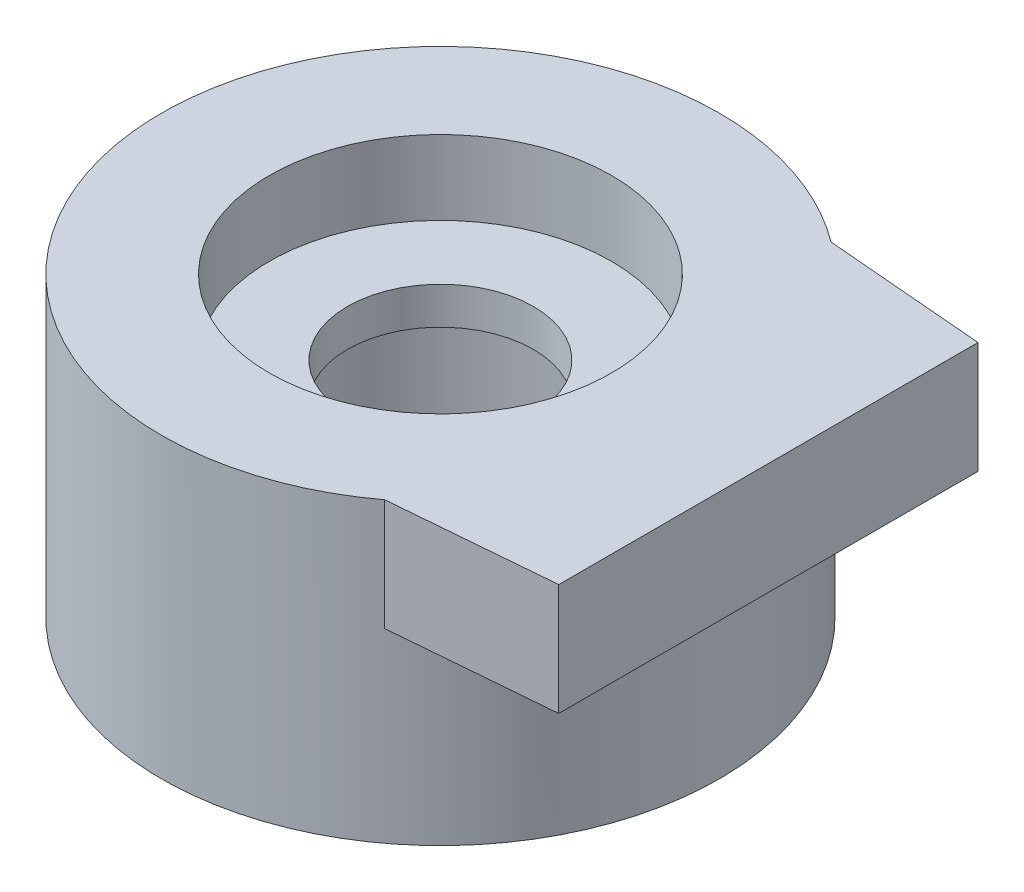
ISO-10303-21;
HEADER;
FILE_DESCRIPTION(('STEP AP214'),'2;1');
FILE_NAME('part.step','',(''),(''),'','','');
FILE_SCHEMA(('AUTOMOTIVE_DESIGN { 1 0 10303 214 1 1 1 1 }'));
ENDSEC;
DATA;
#1=APPLICATION_CONTEXT('core data for automotive mechanical design processes');
#2=APPLICATION_PROTOCOL_DEFINITION('international standard','automotive_design',2000,#1);
#3=PRODUCT_CONTEXT('',#1,'mechanical');
#4=PRODUCT('Part','Part','',(#3));
#5=PRODUCT_RELATED_PRODUCT_CATEGORY('part','',(#4));
#6=PRODUCT_DEFINITION_FORMATION('','',#4);
#7=PRODUCT_DEFINITION_CONTEXT('part definition',#1,'design');
#8=PRODUCT_DEFINITION('design','',#6,#7);
#9=PRODUCT_DEFINITION_SHAPE('','',#8);
#10=(LENGTH_UNIT() NAMED_UNIT(*) SI_UNIT(.MILLI.,.METRE.));
#11=(NAMED_UNIT(*) PLANE_ANGLE_UNIT() SI_UNIT($,.RADIAN.));
#12=(NAMED_UNIT(*) SI_UNIT($,.STERADIAN.) SOLID_ANGLE_UNIT());
#13=UNCERTAINTY_MEASURE_WITH_UNIT(LENGTH_MEASURE(1.E-05),#10,'distance_accuracy_value','');
#14=(GEOMETRIC_REPRESENTATION_CONTEXT(3) GLOBAL_UNCERTAINTY_ASSIGNED_CONTEXT((#13)) GLOBAL_UNIT_ASSIGNED_CONTEXT((#10,
#11,#12)) REPRESENTATION_CONTEXT('',''));
#15=CARTESIAN_POINT('',(0.,0.,0.));
#16=DIRECTION('',(0.,0.,1.));
#17=DIRECTION('',(1.,0.,0.));
#18=AXIS2_PLACEMENT_3D('',#15,#16,#17);
#19=CARTESIAN_POINT('',(0.,-1.5,0.));
#20=DIRECTION('',(0.,1.,0.));
#21=DIRECTION('',(0.,0.,1.));
#22=AXIS2_PLACEMENT_3D('',#19,#20,#21);
#23=CYLINDRICAL_SURFACE('',#22,1.25);
#24=CARTESIAN_POINT('',(0.,3.,0.));
#25=DIRECTION('',(0.,1.,0.));
#26=DIRECTION('',(0.,0.,1.));
#27=AXIS2_PLACEMENT_3D('',#24,#25,#26);
#28=CIRCLE('',#27,1.25);
#29=CARTESIAN_POINT('',(0.,3.,1.25));
#30=VERTEX_POINT('',#29);
#31=EDGE_CURVE('E22',#30,#30,#28,.F.);
#32=ORIENTED_EDGE('',*,*,#31,.F.);
#33=EDGE_LOOP('',(#32));
#34=FACE_BOUND('',#33,.T.);
#35=CARTESIAN_POINT('',(0.,2.5,0.));
#36=DIRECTION('',(0.,1.,0.));
#37=DIRECTION('',(0.,0.,1.));
#38=AXIS2_PLACEMENT_3D('',#35,#36,#37);
#39=CIRCLE('',#38,1.25);
#40=CARTESIAN_POINT('',(0.,2.5,1.25));
#41=VERTEX_POINT('',#40);
#42=EDGE_CURVE('E142',#41,#41,#39,.T.);
#43=ORIENTED_EDGE('',*,*,#42,.F.);
#44=EDGE_LOOP('',(#43));
#45=FACE_BOUND('',#44,.T.);
#46=ADVANCED_FACE('F19',(#34,#45),#23,.F.);
#47=CARTESIAN_POINT('',(0.,3.,0.));
#48=DIRECTION('',(0.,1.,0.));
#49=DIRECTION('',(0.,0.,1.));
#50=AXIS2_PLACEMENT_3D('',#47,#48,#49);
#51=PLANE('',#50);
#52=CARTESIAN_POINT('',(0.,3.,0.));
#53=DIRECTION('',(0.,1.,0.));
#54=DIRECTION('',(0.,0.,1.));
#55=AXIS2_PLACEMENT_3D('',#52,#53,#54);
#56=CIRCLE('',#55,2.3);
#57=CARTESIAN_POINT('',(0.,3.,2.3));
#58=VERTEX_POINT('',#57);
#59=EDGE_CURVE('E88',#58,#58,#56,.T.);
#60=ORIENTED_EDGE('',*,*,#59,.T.);
#61=EDGE_LOOP('',(#60));
#62=FACE_BOUND('',#61,.T.);
#63=ORIENTED_EDGE('',*,*,#31,.T.);
#64=EDGE_LOOP('',(#63));
#65=FACE_BOUND('',#64,.T.);
#66=ADVANCED_FACE('F153',(#62,#65),#51,.T.);
#67=CARTESIAN_POINT('',(0.,2.5,0.));
#68=DIRECTION('',(0.,-1.,0.));
#69=DIRECTION('',(0.,0.,-1.));
#70=AXIS2_PLACEMENT_3D('',#67,#68,#69);
#71=PLANE('',#70);
#72=ORIENTED_EDGE('',*,*,#42,.T.);
#73=EDGE_LOOP('',(#72));
#74=FACE_BOUND('',#73,.T.);
#75=CARTESIAN_POINT('',(0.,2.5,0.));
#76=DIRECTION('',(0.,-1.,0.));
#77=DIRECTION('',(0.,0.,-1.));
#78=AXIS2_PLACEMENT_3D('',#75,#76,#77);
#79=CIRCLE('',#78,2.3);
#80=CARTESIAN_POINT('',(0.,2.5,-2.3));
#81=VERTEX_POINT('',#80);
#82=EDGE_CURVE('E120',#81,#81,#79,.T.);
#83=ORIENTED_EDGE('',*,*,#82,.T.);
#84=EDGE_LOOP('',(#83));
#85=FACE_BOUND('',#84,.T.);
#86=ADVANCED_FACE('F161',(#74,#85),#71,.T.);
#87=CARTESIAN_POINT('',(4.40776789419964,0.,2.81766907451634));
#88=DIRECTION('',(-1.,0.,0.));
#89=DIRECTION('',(0.,0.,1.));
#90=AXIS2_PLACEMENT_3D('',#87,#88,#89);
#91=PLANE('',#90);
#92=DIRECTION('',(0.,1.,0.));
#93=VECTOR('',#92,1.);
#94=CARTESIAN_POINT('',(4.40776789419964,2.5,-2.81766907451634));
#95=LINE('',#94,#93);
#96=CARTESIAN_POINT('',(4.40776789419964,4.,-2.81766907451634));
#97=VERTEX_POINT('',#96);
#98=CARTESIAN_POINT('',(4.40776789419964,2.5,-2.81766907451634));
#99=VERTEX_POINT('',#98);
#100=EDGE_CURVE('E58',#97,#99,#95,.F.);
#101=ORIENTED_EDGE('',*,*,#100,.F.);
#102=DIRECTION('',(0.,0.,1.));
#103=VECTOR('',#102,1.);
#104=CARTESIAN_POINT('',(4.40776789419964,4.,0.));
#105=LINE('',#104,#103);
#106=CARTESIAN_POINT('',(4.40776789419964,4.,2.81766907451634));
#107=VERTEX_POINT('',#106);
#108=EDGE_CURVE('E72',#107,#97,#105,.F.);
#109=ORIENTED_EDGE('',*,*,#108,.F.);
#110=DIRECTION('',(0.,1.,0.));
#111=VECTOR('',#110,1.);
#112=CARTESIAN_POINT('',(4.40776789419964,2.5,2.81766907451634));
#113=LINE('',#112,#111);
#114=CARTESIAN_POINT('',(4.40776789419964,2.5,2.81766907451634));
#115=VERTEX_POINT('',#114);
#116=EDGE_CURVE('E67',#115,#107,#113,.T.);
#117=ORIENTED_EDGE('',*,*,#116,.F.);
#118=DIRECTION('',(0.,0.,-1.));
#119=VECTOR('',#118,1.);
#120=CARTESIAN_POINT('',(4.40776789419964,2.5,0.));
#121=LINE('',#120,#119);
#122=EDGE_CURVE('E70',#99,#115,#121,.F.);
#123=ORIENTED_EDGE('',*,*,#122,.F.);
#124=EDGE_LOOP('',(#101,#109,#117,#123));
#125=FACE_BOUND('',#124,.T.);
#126=ADVANCED_FACE('F68',(#125),#91,.F.);
#127=CARTESIAN_POINT('',(14.1683994375414,2.5,-1.9928977970372));
#128=DIRECTION('',(0.0841997187707069,0.,-0.996448898518601));
#129=DIRECTION('',(-0.996448898518601,0.,-0.0841997187707069));
#130=AXIS2_PLACEMENT_3D('',#127,#128,#129);
#131=PLANE('',#130);
#132=DIRECTION('',(0.,1.,0.));
#133=VECTOR('',#132,1.);
#134=CARTESIAN_POINT('',(2.25,2.5,-3.));
#135=LINE('',#134,#133);
#136=CARTESIAN_POINT('',(2.25,2.5,-3.));
#137=VERTEX_POINT('',#136);
#138=CARTESIAN_POINT('',(2.25,4.,-3.));
#139=VERTEX_POINT('',#138);
#140=EDGE_CURVE('E74',#137,#139,#135,.T.);
#141=ORIENTED_EDGE('',*,*,#140,.T.);
#142=DIRECTION('',(-0.996448898518601,0.,-0.0841997187707062));
#143=VECTOR('',#142,1.);
#144=CARTESIAN_POINT('',(4.40776789419964,4.,-2.81766907451634));
#145=LINE('',#144,#143);
#146=EDGE_CURVE('E119',#97,#139,#145,.T.);
#147=ORIENTED_EDGE('',*,*,#146,.F.);
#148=ORIENTED_EDGE('',*,*,#100,.T.);
#149=DIRECTION('',(0.996448898518601,0.,0.0841997187707062));
#150=VECTOR('',#149,1.);
#151=CARTESIAN_POINT('',(2.25,2.5,-3.));
#152=LINE('',#151,#150);
#153=EDGE_CURVE('E82',#137,#99,#152,.T.);
#154=ORIENTED_EDGE('',*,*,#153,.F.);
#155=EDGE_LOOP('',(#141,#147,#148,#154));
#156=FACE_BOUND('',#155,.T.);
#157=ADVANCED_FACE('F190',(#156),#131,.T.);
#158=CARTESIAN_POINT('',(14.1683994375414,2.5,1.9928977970372));
#159=DIRECTION('',(0.0841997187707063,0.,0.996448898518602));
#160=DIRECTION('',(0.996448898518602,0.,-0.0841997187707063));
#161=AXIS2_PLACEMENT_3D('',#158,#159,#160);
#162=PLANE('',#161);
#163=DIRECTION('',(0.,1.,0.));
#164=VECTOR('',#163,1.);
#165=CARTESIAN_POINT('',(2.25,2.5,3.));
#166=LINE('',#165,#164);
#167=CARTESIAN_POINT('',(2.25,4.,3.));
#168=VERTEX_POINT('',#167);
#169=CARTESIAN_POINT('',(2.25,2.5,3.));
#170=VERTEX_POINT('',#169);
#171=EDGE_CURVE('E38',#168,#170,#166,.F.);
#172=ORIENTED_EDGE('',*,*,#171,.T.);
#173=DIRECTION('',(-0.996448898518602,0.,0.0841997187707063));
#174=VECTOR('',#173,1.);
#175=CARTESIAN_POINT('',(4.40776789419964,2.5,2.81766907451634));
#176=LINE('',#175,#174);
#177=EDGE_CURVE('E76',#115,#170,#176,.T.);
#178=ORIENTED_EDGE('',*,*,#177,.F.);
#179=ORIENTED_EDGE('',*,*,#116,.T.);
#180=DIRECTION('',(0.996448898518602,0.,-0.0841997187707063));
#181=VECTOR('',#180,1.);
#182=CARTESIAN_POINT('',(2.25,4.,3.));
#183=LINE('',#182,#181);
#184=EDGE_CURVE('E136',#168,#107,#183,.T.);
#185=ORIENTED_EDGE('',*,*,#184,.F.);
#186=EDGE_LOOP('',(#172,#178,#179,#185));
#187=FACE_BOUND('',#186,.T.);
#188=ADVANCED_FACE('F77',(#187),#162,.T.);
#189=CARTESIAN_POINT('',(0.,3.,0.));
#190=DIRECTION('',(0.,1.,0.));
#191=DIRECTION('',(0.,0.,1.));
#192=AXIS2_PLACEMENT_3D('',#189,#190,#191);
#193=CYLINDRICAL_SURFACE('',#192,2.3);
#194=CARTESIAN_POINT('',(0.,4.,0.));
#195=DIRECTION('',(0.,1.,0.));
#196=DIRECTION('',(0.,0.,1.));
#197=AXIS2_PLACEMENT_3D('',#194,#195,#196);
#198=CIRCLE('',#197,2.3);
#199=CARTESIAN_POINT('',(0.,4.,2.3));
#200=VERTEX_POINT('',#199);
#201=EDGE_CURVE('E132',#200,#200,#198,.F.);
#202=ORIENTED_EDGE('',*,*,#201,.F.);
#203=EDGE_LOOP('',(#202));
#204=FACE_BOUND('',#203,.T.);
#205=ORIENTED_EDGE('',*,*,#59,.F.);
#206=EDGE_LOOP('',(#205));
#207=FACE_BOUND('',#206,.T.);
#208=ADVANCED_FACE('F184',(#204,#207),#193,.F.);
#209=CARTESIAN_POINT('',(0.,2.5,0.));
#210=DIRECTION('',(0.,-1.,0.));
#211=DIRECTION('',(0.,0.,-1.));
#212=AXIS2_PLACEMENT_3D('',#209,#210,#211);
#213=PLANE('',#212);
#214=CARTESIAN_POINT('',(0.,2.5,0.));
#215=DIRECTION('',(0.,-1.,0.));
#216=DIRECTION('',(0.,0.,-1.));
#217=AXIS2_PLACEMENT_3D('',#214,#215,#216);
#218=CIRCLE('',#217,3.75);
#219=EDGE_CURVE('E128',#137,#170,#218,.T.);
#220=ORIENTED_EDGE('',*,*,#219,.F.);
#221=ORIENTED_EDGE('',*,*,#153,.T.);
#222=ORIENTED_EDGE('',*,*,#122,.T.);
#223=ORIENTED_EDGE('',*,*,#177,.T.);
#224=EDGE_LOOP('',(#220,#221,#222,#223));
#225=FACE_BOUND('',#224,.T.);
#226=ADVANCED_FACE('F85',(#225),#213,.T.);
#227=CARTESIAN_POINT('',(0.,2.5,0.));
#228=DIRECTION('',(0.,-1.,0.));
#229=DIRECTION('',(0.,0.,-1.));
#230=AXIS2_PLACEMENT_3D('',#227,#228,#229);
#231=CYLINDRICAL_SURFACE('',#230,2.3);
#232=ORIENTED_EDGE('',*,*,#82,.F.);
#233=EDGE_LOOP('',(#232));
#234=FACE_BOUND('',#233,.T.);
#235=CARTESIAN_POINT('',(0.,0.,0.));
#236=DIRECTION('',(0.,-1.,0.));
#237=DIRECTION('',(0.,0.,-1.));
#238=AXIS2_PLACEMENT_3D('',#235,#236,#237);
#239=CIRCLE('',#238,2.3);
#240=CARTESIAN_POINT('',(0.,0.,-2.3));
#241=VERTEX_POINT('',#240);
#242=EDGE_CURVE('E102',#241,#241,#239,.T.);
#243=ORIENTED_EDGE('',*,*,#242,.T.);
#244=EDGE_LOOP('',(#243));
#245=FACE_BOUND('',#244,.T.);
#246=ADVANCED_FACE('F177',(#234,#245),#231,.F.);
#247=CARTESIAN_POINT('',(0.,4.,0.));
#248=DIRECTION('',(0.,1.,0.));
#249=DIRECTION('',(0.,0.,1.));
#250=AXIS2_PLACEMENT_3D('',#247,#248,#249);
#251=PLANE('',#250);
#252=ORIENTED_EDGE('',*,*,#201,.T.);
#253=EDGE_LOOP('',(#252));
#254=FACE_BOUND('',#253,.T.);
#255=CARTESIAN_POINT('',(0.,4.,0.));
#256=DIRECTION('',(0.,-1.,0.));
#257=DIRECTION('',(0.,0.,-1.));
#258=AXIS2_PLACEMENT_3D('',#255,#256,#257);
#259=CIRCLE('',#258,3.75);
#260=EDGE_CURVE('E29',#168,#139,#259,.T.);
#261=ORIENTED_EDGE('',*,*,#260,.F.);
#262=ORIENTED_EDGE('',*,*,#184,.T.);
#263=ORIENTED_EDGE('',*,*,#108,.T.);
#264=ORIENTED_EDGE('',*,*,#146,.T.);
#265=EDGE_LOOP('',(#261,#262,#263,#264));
#266=FACE_BOUND('',#265,.T.);
#267=ADVANCED_FACE('F170',(#254,#266),#251,.T.);
#268=CARTESIAN_POINT('',(0.,0.,0.));
#269=DIRECTION('',(0.,1.,0.));
#270=DIRECTION('',(0.,0.,1.));
#271=AXIS2_PLACEMENT_3D('',#268,#269,#270);
#272=PLANE('',#271);
#273=CARTESIAN_POINT('',(0.,0.,0.));
#274=DIRECTION('',(0.,-1.,0.));
#275=DIRECTION('',(0.,0.,-1.));
#276=AXIS2_PLACEMENT_3D('',#273,#274,#275);
#277=CIRCLE('',#276,3.75);
#278=CARTESIAN_POINT('',(0.,0.,-3.75));
#279=VERTEX_POINT('',#278);
#280=EDGE_CURVE('E12',#279,#279,#277,.F.);
#281=ORIENTED_EDGE('',*,*,#280,.F.);
#282=EDGE_LOOP('',(#281));
#283=FACE_BOUND('',#282,.T.);
#284=ORIENTED_EDGE('',*,*,#242,.F.);
#285=EDGE_LOOP('',(#284));
#286=FACE_BOUND('',#285,.T.);
#287=ADVANCED_FACE('F165',(#283,#286),#272,.F.);
#288=CARTESIAN_POINT('',(0.,4.,0.));
#289=DIRECTION('',(0.,-1.,0.));
#290=DIRECTION('',(0.,0.,-1.));
#291=AXIS2_PLACEMENT_3D('',#288,#289,#290);
#292=CYLINDRICAL_SURFACE('',#291,3.75);
#293=ORIENTED_EDGE('',*,*,#171,.F.);
#294=ORIENTED_EDGE('',*,*,#260,.T.);
#295=ORIENTED_EDGE('',*,*,#140,.F.);
#296=ORIENTED_EDGE('',*,*,#219,.T.);
#297=EDGE_LOOP('',(#293,#294,#295,#296));
#298=FACE_BOUND('',#297,.T.);
#299=ORIENTED_EDGE('',*,*,#280,.T.);
#300=EDGE_LOOP('',(#299));
#301=FACE_BOUND('',#300,.T.);
#302=ADVANCED_FACE('F163',(#298,#301),#292,.T.);
#303=CLOSED_SHELL('',(#46,#66,#86,#126,#157,#188,#208,#226,#246,#267,#287,#302));
#304=MANIFOLD_SOLID_BREP('B1',#303);
#305=ADVANCED_BREP_SHAPE_REPRESENTATION('',(#18,#304),#14);
#306=SHAPE_DEFINITION_REPRESENTATION(#9,#305);
ENDSEC;
END-ISO-10303-21;
